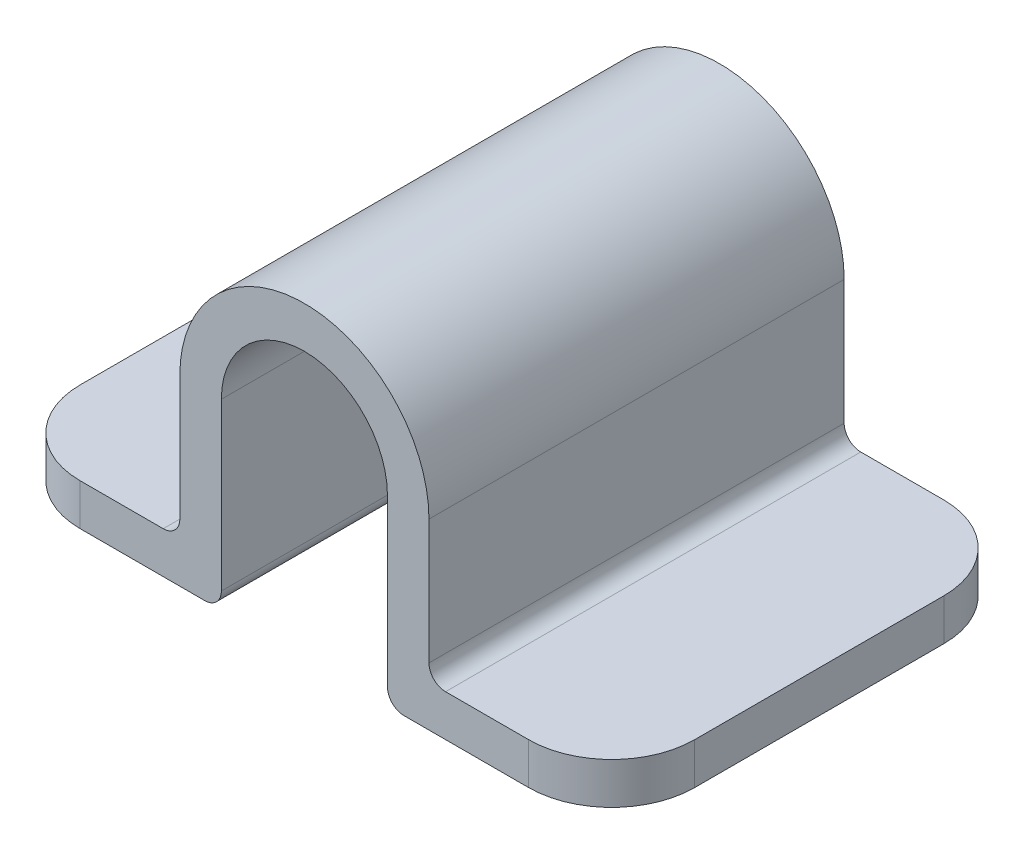
ISO-10303-21;
HEADER;
FILE_DESCRIPTION(('STEP AP214'),'2;1');
FILE_NAME('part.step','',(''),(''),'','','');
FILE_SCHEMA(('AUTOMOTIVE_DESIGN { 1 0 10303 214 1 1 1 1 }'));
ENDSEC;
DATA;
#1=APPLICATION_CONTEXT('core data for automotive mechanical design processes');
#2=APPLICATION_PROTOCOL_DEFINITION('international standard','automotive_design',2000,#1);
#3=PRODUCT_CONTEXT('',#1,'mechanical');
#4=PRODUCT('Part','Part','',(#3));
#5=PRODUCT_RELATED_PRODUCT_CATEGORY('part','',(#4));
#6=PRODUCT_DEFINITION_FORMATION('','',#4);
#7=PRODUCT_DEFINITION_CONTEXT('part definition',#1,'design');
#8=PRODUCT_DEFINITION('design','',#6,#7);
#9=PRODUCT_DEFINITION_SHAPE('','',#8);
#10=(LENGTH_UNIT() NAMED_UNIT(*) SI_UNIT(.MILLI.,.METRE.));
#11=(NAMED_UNIT(*) PLANE_ANGLE_UNIT() SI_UNIT($,.RADIAN.));
#12=(NAMED_UNIT(*) SI_UNIT($,.STERADIAN.) SOLID_ANGLE_UNIT());
#13=UNCERTAINTY_MEASURE_WITH_UNIT(LENGTH_MEASURE(1.E-05),#10,'distance_accuracy_value','');
#14=(GEOMETRIC_REPRESENTATION_CONTEXT(3) GLOBAL_UNCERTAINTY_ASSIGNED_CONTEXT((#13)) GLOBAL_UNIT_ASSIGNED_CONTEXT((#10,
#11,#12)) REPRESENTATION_CONTEXT('',''));
#15=CARTESIAN_POINT('',(0.,0.,0.));
#16=DIRECTION('',(0.,0.,1.));
#17=DIRECTION('',(1.,0.,0.));
#18=AXIS2_PLACEMENT_3D('',#15,#16,#17);
#19=CARTESIAN_POINT('',(0.,0.,-50.));
#20=DIRECTION('',(0.,0.,1.));
#21=DIRECTION('',(1.,0.,0.));
#22=AXIS2_PLACEMENT_3D('',#19,#20,#21);
#23=CYLINDRICAL_SURFACE('',#22,15.);
#24=CARTESIAN_POINT('',(0.,0.,0.));
#25=DIRECTION('',(0.,0.,1.));
#26=DIRECTION('',(1.,0.,0.));
#27=AXIS2_PLACEMENT_3D('',#24,#25,#26);
#28=CIRCLE('',#27,15.);
#29=CARTESIAN_POINT('',(15.,0.,0.));
#30=VERTEX_POINT('',#29);
#31=CARTESIAN_POINT('',(-15.,0.,0.));
#32=VERTEX_POINT('',#31);
#33=EDGE_CURVE('E263',#30,#32,#28,.T.);
#34=ORIENTED_EDGE('',*,*,#33,.F.);
#35=DIRECTION('',(0.,0.,1.));
#36=VECTOR('',#35,1.);
#37=CARTESIAN_POINT('',(15.,0.,-50.));
#38=LINE('',#37,#36);
#39=CARTESIAN_POINT('',(15.,0.,-50.));
#40=VERTEX_POINT('',#39);
#41=EDGE_CURVE('E213',#40,#30,#38,.T.);
#42=ORIENTED_EDGE('',*,*,#41,.F.);
#43=CARTESIAN_POINT('',(0.,0.,-50.));
#44=DIRECTION('',(0.,0.,1.));
#45=DIRECTION('',(1.,0.,0.));
#46=AXIS2_PLACEMENT_3D('',#43,#44,#45);
#47=CIRCLE('',#46,15.);
#48=CARTESIAN_POINT('',(-15.,0.,-50.));
#49=VERTEX_POINT('',#48);
#50=EDGE_CURVE('E206',#40,#49,#47,.T.);
#51=ORIENTED_EDGE('',*,*,#50,.T.);
#52=DIRECTION('',(0.,0.,1.));
#53=VECTOR('',#52,1.);
#54=CARTESIAN_POINT('',(-15.,0.,-50.));
#55=LINE('',#54,#53);
#56=EDGE_CURVE('E188',#49,#32,#55,.T.);
#57=ORIENTED_EDGE('',*,*,#56,.T.);
#58=EDGE_LOOP('',(#34,#42,#51,#57));
#59=FACE_BOUND('',#58,.T.);
#60=ADVANCED_FACE('F50',(#59),#23,.T.);
#61=CARTESIAN_POINT('',(15.,0.,-50.));
#62=DIRECTION('',(-1.,0.,0.));
#63=DIRECTION('',(0.,0.,1.));
#64=AXIS2_PLACEMENT_3D('',#61,#62,#63);
#65=PLANE('',#64);
#66=DIRECTION('',(0.,-1.,0.));
#67=VECTOR('',#66,1.);
#68=CARTESIAN_POINT('',(15.,0.,0.));
#69=LINE('',#68,#67);
#70=CARTESIAN_POINT('',(15.,-15.,0.));
#71=VERTEX_POINT('',#70);
#72=EDGE_CURVE('E216',#30,#71,#69,.T.);
#73=ORIENTED_EDGE('',*,*,#72,.T.);
#74=DIRECTION('',(0.,0.,1.));
#75=VECTOR('',#74,1.);
#76=CARTESIAN_POINT('',(15.,-15.,-50.));
#77=LINE('',#76,#75);
#78=CARTESIAN_POINT('',(15.,-15.,-50.));
#79=VERTEX_POINT('',#78);
#80=EDGE_CURVE('E310',#79,#71,#77,.T.);
#81=ORIENTED_EDGE('',*,*,#80,.F.);
#82=DIRECTION('',(0.,-1.,0.));
#83=VECTOR('',#82,1.);
#84=CARTESIAN_POINT('',(15.,0.,-50.));
#85=LINE('',#84,#83);
#86=EDGE_CURVE('E200',#40,#79,#85,.T.);
#87=ORIENTED_EDGE('',*,*,#86,.F.);
#88=ORIENTED_EDGE('',*,*,#41,.T.);
#89=EDGE_LOOP('',(#73,#81,#87,#88));
#90=FACE_BOUND('',#89,.T.);
#91=ADVANCED_FACE('F432',(#90),#65,.F.);
#92=CARTESIAN_POINT('',(17.,-15.,-50.));
#93=DIRECTION('',(0.,0.,1.));
#94=DIRECTION('',(1.,0.,0.));
#95=AXIS2_PLACEMENT_3D('',#92,#93,#94);
#96=CYLINDRICAL_SURFACE('',#95,2.);
#97=CARTESIAN_POINT('',(17.,-15.,0.));
#98=DIRECTION('',(0.,0.,-1.));
#99=DIRECTION('',(-1.,0.,0.));
#100=AXIS2_PLACEMENT_3D('',#97,#98,#99);
#101=CIRCLE('',#100,2.);
#102=CARTESIAN_POINT('',(17.,-17.,0.));
#103=VERTEX_POINT('',#102);
#104=EDGE_CURVE('E220',#103,#71,#101,.T.);
#105=ORIENTED_EDGE('',*,*,#104,.F.);
#106=DIRECTION('',(0.,0.,1.));
#107=VECTOR('',#106,1.);
#108=CARTESIAN_POINT('',(17.,-17.,-50.));
#109=LINE('',#108,#107);
#110=CARTESIAN_POINT('',(17.,-17.,-50.));
#111=VERTEX_POINT('',#110);
#112=EDGE_CURVE('E313',#111,#103,#109,.T.);
#113=ORIENTED_EDGE('',*,*,#112,.F.);
#114=CARTESIAN_POINT('',(17.,-15.,-50.));
#115=DIRECTION('',(0.,0.,-1.));
#116=DIRECTION('',(-1.,0.,0.));
#117=AXIS2_PLACEMENT_3D('',#114,#115,#116);
#118=CIRCLE('',#117,2.);
#119=EDGE_CURVE('E257',#111,#79,#118,.T.);
#120=ORIENTED_EDGE('',*,*,#119,.T.);
#121=ORIENTED_EDGE('',*,*,#80,.T.);
#122=EDGE_LOOP('',(#105,#113,#120,#121));
#123=FACE_BOUND('',#122,.T.);
#124=ADVANCED_FACE('F437',(#123),#96,.F.);
#125=CARTESIAN_POINT('',(17.,-17.,-50.));
#126=DIRECTION('',(0.,-1.,0.));
#127=DIRECTION('',(0.,0.,-1.));
#128=AXIS2_PLACEMENT_3D('',#125,#126,#127);
#129=PLANE('',#128);
#130=DIRECTION('',(1.,0.,0.));
#131=VECTOR('',#130,1.);
#132=CARTESIAN_POINT('',(17.,-17.,0.));
#133=LINE('',#132,#131);
#134=CARTESIAN_POINT('',(27.,-17.,0.));
#135=VERTEX_POINT('',#134);
#136=EDGE_CURVE('E300',#103,#135,#133,.T.);
#137=ORIENTED_EDGE('',*,*,#136,.T.);
#138=CARTESIAN_POINT('',(27.,-17.,-10.));
#139=DIRECTION('',(0.,-1.,0.));
#140=DIRECTION('',(0.,0.,-1.));
#141=AXIS2_PLACEMENT_3D('',#138,#139,#140);
#142=CIRCLE('',#141,10.);
#143=CARTESIAN_POINT('',(37.,-17.,-10.));
#144=VERTEX_POINT('',#143);
#145=EDGE_CURVE('E378',#135,#144,#142,.F.);
#146=ORIENTED_EDGE('',*,*,#145,.T.);
#147=DIRECTION('',(0.,0.,1.));
#148=VECTOR('',#147,1.);
#149=CARTESIAN_POINT('',(37.,-17.,-50.));
#150=LINE('',#149,#148);
#151=CARTESIAN_POINT('',(37.,-17.,-40.));
#152=VERTEX_POINT('',#151);
#153=EDGE_CURVE('E316',#152,#144,#150,.T.);
#154=ORIENTED_EDGE('',*,*,#153,.F.);
#155=CARTESIAN_POINT('',(27.,-17.,-40.));
#156=DIRECTION('',(0.,-1.,0.));
#157=DIRECTION('',(0.,0.,-1.));
#158=AXIS2_PLACEMENT_3D('',#155,#156,#157);
#159=CIRCLE('',#158,10.);
#160=CARTESIAN_POINT('',(27.,-17.,-50.));
#161=VERTEX_POINT('',#160);
#162=EDGE_CURVE('E375',#152,#161,#159,.F.);
#163=ORIENTED_EDGE('',*,*,#162,.T.);
#164=DIRECTION('',(1.,0.,0.));
#165=VECTOR('',#164,1.);
#166=CARTESIAN_POINT('',(17.,-17.,-50.));
#167=LINE('',#166,#165);
#168=EDGE_CURVE('E254',#111,#161,#167,.T.);
#169=ORIENTED_EDGE('',*,*,#168,.F.);
#170=ORIENTED_EDGE('',*,*,#112,.T.);
#171=EDGE_LOOP('',(#137,#146,#154,#163,#169,#170));
#172=FACE_BOUND('',#171,.T.);
#173=ADVANCED_FACE('F518',(#172),#129,.F.);
#174=CARTESIAN_POINT('',(37.,-17.,-50.));
#175=DIRECTION('',(-1.,0.,0.));
#176=DIRECTION('',(0.,0.,1.));
#177=AXIS2_PLACEMENT_3D('',#174,#175,#176);
#178=PLANE('',#177);
#179=ORIENTED_EDGE('',*,*,#153,.T.);
#180=DIRECTION('',(0.,-1.,0.));
#181=VECTOR('',#180,1.);
#182=CARTESIAN_POINT('',(37.,-22.,-10.));
#183=LINE('',#182,#181);
#184=CARTESIAN_POINT('',(37.,-22.,-10.));
#185=VERTEX_POINT('',#184);
#186=EDGE_CURVE('E359',#144,#185,#183,.T.);
#187=ORIENTED_EDGE('',*,*,#186,.T.);
#188=DIRECTION('',(0.,0.,1.));
#189=VECTOR('',#188,1.);
#190=CARTESIAN_POINT('',(37.,-22.,-50.));
#191=LINE('',#190,#189);
#192=CARTESIAN_POINT('',(37.,-22.,-40.));
#193=VERTEX_POINT('',#192);
#194=EDGE_CURVE('E320',#193,#185,#191,.T.);
#195=ORIENTED_EDGE('',*,*,#194,.F.);
#196=DIRECTION('',(0.,-1.,0.));
#197=VECTOR('',#196,1.);
#198=CARTESIAN_POINT('',(37.,-17.,-40.));
#199=LINE('',#198,#197);
#200=EDGE_CURVE('E309',#193,#152,#199,.F.);
#201=ORIENTED_EDGE('',*,*,#200,.T.);
#202=EDGE_LOOP('',(#179,#187,#195,#201));
#203=FACE_BOUND('',#202,.T.);
#204=ADVANCED_FACE('F509',(#203),#178,.F.);
#205=CARTESIAN_POINT('',(12.,-22.,-50.));
#206=DIRECTION('',(0.,-1.,0.));
#207=DIRECTION('',(0.,0.,-1.));
#208=AXIS2_PLACEMENT_3D('',#205,#206,#207);
#209=PLANE('',#208);
#210=ORIENTED_EDGE('',*,*,#194,.T.);
#211=CARTESIAN_POINT('',(27.,-22.,-10.));
#212=DIRECTION('',(0.,-1.,0.));
#213=DIRECTION('',(0.,0.,-1.));
#214=AXIS2_PLACEMENT_3D('',#211,#212,#213);
#215=CIRCLE('',#214,10.);
#216=CARTESIAN_POINT('',(27.,-22.,0.));
#217=VERTEX_POINT('',#216);
#218=EDGE_CURVE('E366',#185,#217,#215,.T.);
#219=ORIENTED_EDGE('',*,*,#218,.T.);
#220=DIRECTION('',(1.,0.,0.));
#221=VECTOR('',#220,1.);
#222=CARTESIAN_POINT('',(12.,-22.,0.));
#223=LINE('',#222,#221);
#224=CARTESIAN_POINT('',(12.,-22.,0.));
#225=VERTEX_POINT('',#224);
#226=EDGE_CURVE('E296',#225,#217,#223,.T.);
#227=ORIENTED_EDGE('',*,*,#226,.F.);
#228=DIRECTION('',(0.,0.,1.));
#229=VECTOR('',#228,1.);
#230=CARTESIAN_POINT('',(12.,-22.,-50.));
#231=LINE('',#230,#229);
#232=CARTESIAN_POINT('',(12.,-22.,-50.));
#233=VERTEX_POINT('',#232);
#234=EDGE_CURVE('E324',#233,#225,#231,.T.);
#235=ORIENTED_EDGE('',*,*,#234,.F.);
#236=DIRECTION('',(1.,0.,0.));
#237=VECTOR('',#236,1.);
#238=CARTESIAN_POINT('',(12.,-22.,-50.));
#239=LINE('',#238,#237);
#240=CARTESIAN_POINT('',(27.,-22.,-50.));
#241=VERTEX_POINT('',#240);
#242=EDGE_CURVE('E250',#233,#241,#239,.T.);
#243=ORIENTED_EDGE('',*,*,#242,.T.);
#244=CARTESIAN_POINT('',(27.,-22.,-40.));
#245=DIRECTION('',(0.,-1.,0.));
#246=DIRECTION('',(0.,0.,-1.));
#247=AXIS2_PLACEMENT_3D('',#244,#245,#246);
#248=CIRCLE('',#247,10.);
#249=EDGE_CURVE('E363',#241,#193,#248,.T.);
#250=ORIENTED_EDGE('',*,*,#249,.T.);
#251=EDGE_LOOP('',(#210,#219,#227,#235,#243,#250));
#252=FACE_BOUND('',#251,.T.);
#253=ADVANCED_FACE('F504',(#252),#209,.T.);
#254=CARTESIAN_POINT('',(12.,-20.,-50.));
#255=DIRECTION('',(0.,0.,1.));
#256=DIRECTION('',(1.,0.,0.));
#257=AXIS2_PLACEMENT_3D('',#254,#255,#256);
#258=CYLINDRICAL_SURFACE('',#257,2.);
#259=CARTESIAN_POINT('',(12.,-20.,0.));
#260=DIRECTION('',(0.,0.,1.));
#261=DIRECTION('',(1.,0.,0.));
#262=AXIS2_PLACEMENT_3D('',#259,#260,#261);
#263=CIRCLE('',#262,2.);
#264=CARTESIAN_POINT('',(10.,-20.,0.));
#265=VERTEX_POINT('',#264);
#266=EDGE_CURVE('E292',#265,#225,#263,.T.);
#267=ORIENTED_EDGE('',*,*,#266,.F.);
#268=DIRECTION('',(0.,0.,1.));
#269=VECTOR('',#268,1.);
#270=CARTESIAN_POINT('',(10.,-20.,-50.));
#271=LINE('',#270,#269);
#272=CARTESIAN_POINT('',(10.,-20.,-50.));
#273=VERTEX_POINT('',#272);
#274=EDGE_CURVE('E327',#273,#265,#271,.T.);
#275=ORIENTED_EDGE('',*,*,#274,.F.);
#276=CARTESIAN_POINT('',(12.,-20.,-50.));
#277=DIRECTION('',(0.,0.,1.));
#278=DIRECTION('',(1.,0.,0.));
#279=AXIS2_PLACEMENT_3D('',#276,#277,#278);
#280=CIRCLE('',#279,2.);
#281=EDGE_CURVE('E246',#273,#233,#280,.T.);
#282=ORIENTED_EDGE('',*,*,#281,.T.);
#283=ORIENTED_EDGE('',*,*,#234,.T.);
#284=EDGE_LOOP('',(#267,#275,#282,#283));
#285=FACE_BOUND('',#284,.T.);
#286=ADVANCED_FACE('F508',(#285),#258,.T.);
#287=CARTESIAN_POINT('',(10.,0.,-50.));
#288=DIRECTION('',(-1.,0.,0.));
#289=DIRECTION('',(0.,0.,1.));
#290=AXIS2_PLACEMENT_3D('',#287,#288,#289);
#291=PLANE('',#290);
#292=DIRECTION('',(0.,-1.,0.));
#293=VECTOR('',#292,1.);
#294=CARTESIAN_POINT('',(10.,0.,0.));
#295=LINE('',#294,#293);
#296=CARTESIAN_POINT('',(10.,0.,0.));
#297=VERTEX_POINT('',#296);
#298=EDGE_CURVE('E288',#297,#265,#295,.T.);
#299=ORIENTED_EDGE('',*,*,#298,.F.);
#300=DIRECTION('',(0.,0.,1.));
#301=VECTOR('',#300,1.);
#302=CARTESIAN_POINT('',(10.,0.,-50.));
#303=LINE('',#302,#301);
#304=CARTESIAN_POINT('',(10.,0.,-50.));
#305=VERTEX_POINT('',#304);
#306=EDGE_CURVE('E330',#305,#297,#303,.T.);
#307=ORIENTED_EDGE('',*,*,#306,.F.);
#308=DIRECTION('',(0.,-1.,0.));
#309=VECTOR('',#308,1.);
#310=CARTESIAN_POINT('',(10.,0.,-50.));
#311=LINE('',#310,#309);
#312=EDGE_CURVE('E242',#305,#273,#311,.T.);
#313=ORIENTED_EDGE('',*,*,#312,.T.);
#314=ORIENTED_EDGE('',*,*,#274,.T.);
#315=EDGE_LOOP('',(#299,#307,#313,#314));
#316=FACE_BOUND('',#315,.T.);
#317=ADVANCED_FACE('F564',(#316),#291,.T.);
#318=CARTESIAN_POINT('',(0.,0.,-50.));
#319=DIRECTION('',(0.,0.,1.));
#320=DIRECTION('',(1.,0.,0.));
#321=AXIS2_PLACEMENT_3D('',#318,#319,#320);
#322=CYLINDRICAL_SURFACE('',#321,10.);
#323=CARTESIAN_POINT('',(0.,0.,0.));
#324=DIRECTION('',(0.,0.,1.));
#325=DIRECTION('',(1.,0.,0.));
#326=AXIS2_PLACEMENT_3D('',#323,#324,#325);
#327=CIRCLE('',#326,10.);
#328=CARTESIAN_POINT('',(-10.,0.,0.));
#329=VERTEX_POINT('',#328);
#330=EDGE_CURVE('E285',#297,#329,#327,.T.);
#331=ORIENTED_EDGE('',*,*,#330,.T.);
#332=DIRECTION('',(0.,0.,1.));
#333=VECTOR('',#332,1.);
#334=CARTESIAN_POINT('',(-10.,0.,-50.));
#335=LINE('',#334,#333);
#336=CARTESIAN_POINT('',(-10.,0.,-50.));
#337=VERTEX_POINT('',#336);
#338=EDGE_CURVE('E333',#337,#329,#335,.T.);
#339=ORIENTED_EDGE('',*,*,#338,.F.);
#340=CARTESIAN_POINT('',(0.,0.,-50.));
#341=DIRECTION('',(0.,0.,1.));
#342=DIRECTION('',(1.,0.,0.));
#343=AXIS2_PLACEMENT_3D('',#340,#341,#342);
#344=CIRCLE('',#343,10.);
#345=EDGE_CURVE('E239',#305,#337,#344,.T.);
#346=ORIENTED_EDGE('',*,*,#345,.F.);
#347=ORIENTED_EDGE('',*,*,#306,.T.);
#348=EDGE_LOOP('',(#331,#339,#346,#347));
#349=FACE_BOUND('',#348,.T.);
#350=ADVANCED_FACE('F554',(#349),#322,.F.);
#351=CARTESIAN_POINT('',(-10.,0.,-50.));
#352=DIRECTION('',(-1.,0.,0.));
#353=DIRECTION('',(0.,0.,1.));
#354=AXIS2_PLACEMENT_3D('',#351,#352,#353);
#355=PLANE('',#354);
#356=DIRECTION('',(0.,-1.,0.));
#357=VECTOR('',#356,1.);
#358=CARTESIAN_POINT('',(-10.,0.,0.));
#359=LINE('',#358,#357);
#360=CARTESIAN_POINT('',(-10.,-20.,0.));
#361=VERTEX_POINT('',#360);
#362=EDGE_CURVE('E282',#329,#361,#359,.T.);
#363=ORIENTED_EDGE('',*,*,#362,.T.);
#364=DIRECTION('',(0.,0.,1.));
#365=VECTOR('',#364,1.);
#366=CARTESIAN_POINT('',(-10.,-20.,-50.));
#367=LINE('',#366,#365);
#368=CARTESIAN_POINT('',(-10.,-20.,-50.));
#369=VERTEX_POINT('',#368);
#370=EDGE_CURVE('E337',#369,#361,#367,.T.);
#371=ORIENTED_EDGE('',*,*,#370,.F.);
#372=DIRECTION('',(0.,-1.,0.));
#373=VECTOR('',#372,1.);
#374=CARTESIAN_POINT('',(-10.,0.,-50.));
#375=LINE('',#374,#373);
#376=EDGE_CURVE('E236',#337,#369,#375,.T.);
#377=ORIENTED_EDGE('',*,*,#376,.F.);
#378=ORIENTED_EDGE('',*,*,#338,.T.);
#379=EDGE_LOOP('',(#363,#371,#377,#378));
#380=FACE_BOUND('',#379,.T.);
#381=ADVANCED_FACE('F544',(#380),#355,.F.);
#382=CARTESIAN_POINT('',(-12.,-20.,-50.));
#383=DIRECTION('',(0.,0.,1.));
#384=DIRECTION('',(1.,0.,0.));
#385=AXIS2_PLACEMENT_3D('',#382,#383,#384);
#386=CYLINDRICAL_SURFACE('',#385,2.);
#387=CARTESIAN_POINT('',(-12.,-20.,0.));
#388=DIRECTION('',(0.,0.,-1.));
#389=DIRECTION('',(-1.,0.,0.));
#390=AXIS2_PLACEMENT_3D('',#387,#388,#389);
#391=CIRCLE('',#390,2.);
#392=CARTESIAN_POINT('',(-12.,-22.,0.));
#393=VERTEX_POINT('',#392);
#394=EDGE_CURVE('E279',#361,#393,#391,.T.);
#395=ORIENTED_EDGE('',*,*,#394,.T.);
#396=DIRECTION('',(0.,0.,1.));
#397=VECTOR('',#396,1.);
#398=CARTESIAN_POINT('',(-12.,-22.,-50.));
#399=LINE('',#398,#397);
#400=CARTESIAN_POINT('',(-12.,-22.,-50.));
#401=VERTEX_POINT('',#400);
#402=EDGE_CURVE('E341',#401,#393,#399,.T.);
#403=ORIENTED_EDGE('',*,*,#402,.F.);
#404=CARTESIAN_POINT('',(-12.,-20.,-50.));
#405=DIRECTION('',(0.,0.,-1.));
#406=DIRECTION('',(-1.,0.,0.));
#407=AXIS2_PLACEMENT_3D('',#404,#405,#406);
#408=CIRCLE('',#407,2.);
#409=EDGE_CURVE('E233',#369,#401,#408,.T.);
#410=ORIENTED_EDGE('',*,*,#409,.F.);
#411=ORIENTED_EDGE('',*,*,#370,.T.);
#412=EDGE_LOOP('',(#395,#403,#410,#411));
#413=FACE_BOUND('',#412,.T.);
#414=ADVANCED_FACE('F499',(#413),#386,.T.);
#415=CARTESIAN_POINT('',(-12.,-22.,-50.));
#416=DIRECTION('',(0.,1.,0.));
#417=DIRECTION('',(0.,0.,1.));
#418=AXIS2_PLACEMENT_3D('',#415,#416,#417);
#419=PLANE('',#418);
#420=DIRECTION('',(-1.,0.,0.));
#421=VECTOR('',#420,1.);
#422=CARTESIAN_POINT('',(-12.,-22.,0.));
#423=LINE('',#422,#421);
#424=CARTESIAN_POINT('',(-27.,-22.,0.));
#425=VERTEX_POINT('',#424);
#426=EDGE_CURVE('E276',#393,#425,#423,.T.);
#427=ORIENTED_EDGE('',*,*,#426,.T.);
#428=CARTESIAN_POINT('',(-27.,-22.,-10.));
#429=DIRECTION('',(0.,1.,0.));
#430=DIRECTION('',(0.,0.,1.));
#431=AXIS2_PLACEMENT_3D('',#428,#429,#430);
#432=CIRCLE('',#431,10.);
#433=CARTESIAN_POINT('',(-37.,-22.,-10.));
#434=VERTEX_POINT('',#433);
#435=EDGE_CURVE('E13',#425,#434,#432,.F.);
#436=ORIENTED_EDGE('',*,*,#435,.T.);
#437=DIRECTION('',(0.,0.,1.));
#438=VECTOR('',#437,1.);
#439=CARTESIAN_POINT('',(-37.,-22.,-50.));
#440=LINE('',#439,#438);
#441=CARTESIAN_POINT('',(-37.,-22.,-40.));
#442=VERTEX_POINT('',#441);
#443=EDGE_CURVE('E345',#442,#434,#440,.T.);
#444=ORIENTED_EDGE('',*,*,#443,.F.);
#445=CARTESIAN_POINT('',(-27.,-22.,-40.));
#446=DIRECTION('',(0.,1.,0.));
#447=DIRECTION('',(0.,0.,1.));
#448=AXIS2_PLACEMENT_3D('',#445,#446,#447);
#449=CIRCLE('',#448,10.);
#450=CARTESIAN_POINT('',(-27.,-22.,-50.));
#451=VERTEX_POINT('',#450);
#452=EDGE_CURVE('E59',#442,#451,#449,.F.);
#453=ORIENTED_EDGE('',*,*,#452,.T.);
#454=DIRECTION('',(-1.,0.,0.));
#455=VECTOR('',#454,1.);
#456=CARTESIAN_POINT('',(-12.,-22.,-50.));
#457=LINE('',#456,#455);
#458=EDGE_CURVE('E229',#401,#451,#457,.T.);
#459=ORIENTED_EDGE('',*,*,#458,.F.);
#460=ORIENTED_EDGE('',*,*,#402,.T.);
#461=EDGE_LOOP('',(#427,#436,#444,#453,#459,#460));
#462=FACE_BOUND('',#461,.T.);
#463=ADVANCED_FACE('F403',(#462),#419,.F.);
#464=CARTESIAN_POINT('',(-37.,-22.,-50.));
#465=DIRECTION('',(1.,0.,0.));
#466=DIRECTION('',(0.,0.,-1.));
#467=AXIS2_PLACEMENT_3D('',#464,#465,#466);
#468=PLANE('',#467);
#469=ORIENTED_EDGE('',*,*,#443,.T.);
#470=DIRECTION('',(0.,1.,0.));
#471=VECTOR('',#470,1.);
#472=CARTESIAN_POINT('',(-37.,-17.,-10.));
#473=LINE('',#472,#471);
#474=CARTESIAN_POINT('',(-37.,-17.,-10.));
#475=VERTEX_POINT('',#474);
#476=EDGE_CURVE('E391',#434,#475,#473,.T.);
#477=ORIENTED_EDGE('',*,*,#476,.T.);
#478=DIRECTION('',(0.,0.,1.));
#479=VECTOR('',#478,1.);
#480=CARTESIAN_POINT('',(-37.,-17.,-50.));
#481=LINE('',#480,#479);
#482=CARTESIAN_POINT('',(-37.,-17.,-40.));
#483=VERTEX_POINT('',#482);
#484=EDGE_CURVE('E348',#483,#475,#481,.T.);
#485=ORIENTED_EDGE('',*,*,#484,.F.);
#486=DIRECTION('',(0.,1.,0.));
#487=VECTOR('',#486,1.);
#488=CARTESIAN_POINT('',(-37.,-22.,-40.));
#489=LINE('',#488,#487);
#490=EDGE_CURVE('E71',#483,#442,#489,.F.);
#491=ORIENTED_EDGE('',*,*,#490,.T.);
#492=EDGE_LOOP('',(#469,#477,#485,#491));
#493=FACE_BOUND('',#492,.T.);
#494=ADVANCED_FACE('F410',(#493),#468,.F.);
#495=CARTESIAN_POINT('',(-17.,-17.,-50.));
#496=DIRECTION('',(0.,1.,0.));
#497=DIRECTION('',(0.,0.,1.));
#498=AXIS2_PLACEMENT_3D('',#495,#496,#497);
#499=PLANE('',#498);
#500=ORIENTED_EDGE('',*,*,#484,.T.);
#501=CARTESIAN_POINT('',(-27.,-17.,-10.));
#502=DIRECTION('',(0.,1.,0.));
#503=DIRECTION('',(0.,0.,1.));
#504=AXIS2_PLACEMENT_3D('',#501,#502,#503);
#505=CIRCLE('',#504,10.);
#506=CARTESIAN_POINT('',(-27.,-17.,0.));
#507=VERTEX_POINT('',#506);
#508=EDGE_CURVE('E398',#475,#507,#505,.T.);
#509=ORIENTED_EDGE('',*,*,#508,.T.);
#510=DIRECTION('',(-1.,0.,0.));
#511=VECTOR('',#510,1.);
#512=CARTESIAN_POINT('',(-17.,-17.,0.));
#513=LINE('',#512,#511);
#514=CARTESIAN_POINT('',(-17.,-17.,0.));
#515=VERTEX_POINT('',#514);
#516=EDGE_CURVE('E272',#515,#507,#513,.T.);
#517=ORIENTED_EDGE('',*,*,#516,.F.);
#518=DIRECTION('',(0.,0.,1.));
#519=VECTOR('',#518,1.);
#520=CARTESIAN_POINT('',(-17.,-17.,-50.));
#521=LINE('',#520,#519);
#522=CARTESIAN_POINT('',(-17.,-17.,-50.));
#523=VERTEX_POINT('',#522);
#524=EDGE_CURVE('E352',#523,#515,#521,.T.);
#525=ORIENTED_EDGE('',*,*,#524,.F.);
#526=DIRECTION('',(-1.,0.,0.));
#527=VECTOR('',#526,1.);
#528=CARTESIAN_POINT('',(-17.,-17.,-50.));
#529=LINE('',#528,#527);
#530=CARTESIAN_POINT('',(-27.,-17.,-50.));
#531=VERTEX_POINT('',#530);
#532=EDGE_CURVE('E225',#523,#531,#529,.T.);
#533=ORIENTED_EDGE('',*,*,#532,.T.);
#534=CARTESIAN_POINT('',(-27.,-17.,-40.));
#535=DIRECTION('',(0.,1.,0.));
#536=DIRECTION('',(0.,0.,1.));
#537=AXIS2_PLACEMENT_3D('',#534,#535,#536);
#538=CIRCLE('',#537,10.);
#539=EDGE_CURVE('E395',#531,#483,#538,.T.);
#540=ORIENTED_EDGE('',*,*,#539,.T.);
#541=EDGE_LOOP('',(#500,#509,#517,#525,#533,#540));
#542=FACE_BOUND('',#541,.T.);
#543=ADVANCED_FACE('F409',(#542),#499,.T.);
#544=CARTESIAN_POINT('',(-17.,-15.,-50.));
#545=DIRECTION('',(0.,0.,1.));
#546=DIRECTION('',(1.,0.,0.));
#547=AXIS2_PLACEMENT_3D('',#544,#545,#546);
#548=CYLINDRICAL_SURFACE('',#547,2.);
#549=CARTESIAN_POINT('',(-17.,-15.,0.));
#550=DIRECTION('',(0.,0.,1.));
#551=DIRECTION('',(1.,0.,0.));
#552=AXIS2_PLACEMENT_3D('',#549,#550,#551);
#553=CIRCLE('',#552,2.);
#554=CARTESIAN_POINT('',(-15.,-15.,0.));
#555=VERTEX_POINT('',#554);
#556=EDGE_CURVE('E268',#515,#555,#553,.T.);
#557=ORIENTED_EDGE('',*,*,#556,.T.);
#558=DIRECTION('',(0.,0.,1.));
#559=VECTOR('',#558,1.);
#560=CARTESIAN_POINT('',(-15.,-15.,-50.));
#561=LINE('',#560,#559);
#562=CARTESIAN_POINT('',(-15.,-15.,-50.));
#563=VERTEX_POINT('',#562);
#564=EDGE_CURVE('E199',#563,#555,#561,.T.);
#565=ORIENTED_EDGE('',*,*,#564,.F.);
#566=CARTESIAN_POINT('',(-17.,-15.,-50.));
#567=DIRECTION('',(0.,0.,1.));
#568=DIRECTION('',(1.,0.,0.));
#569=AXIS2_PLACEMENT_3D('',#566,#567,#568);
#570=CIRCLE('',#569,2.);
#571=EDGE_CURVE('E209',#523,#563,#570,.T.);
#572=ORIENTED_EDGE('',*,*,#571,.F.);
#573=ORIENTED_EDGE('',*,*,#524,.T.);
#574=EDGE_LOOP('',(#557,#565,#572,#573));
#575=FACE_BOUND('',#574,.T.);
#576=ADVANCED_FACE('F421',(#575),#548,.F.);
#577=CARTESIAN_POINT('',(-15.,0.,-50.));
#578=DIRECTION('',(-1.,0.,0.));
#579=DIRECTION('',(0.,0.,1.));
#580=AXIS2_PLACEMENT_3D('',#577,#578,#579);
#581=PLANE('',#580);
#582=DIRECTION('',(0.,-1.,0.));
#583=VECTOR('',#582,1.);
#584=CARTESIAN_POINT('',(-15.,0.,0.));
#585=LINE('',#584,#583);
#586=EDGE_CURVE('E193',#32,#555,#585,.T.);
#587=ORIENTED_EDGE('',*,*,#586,.F.);
#588=ORIENTED_EDGE('',*,*,#56,.F.);
#589=DIRECTION('',(0.,-1.,0.));
#590=VECTOR('',#589,1.);
#591=CARTESIAN_POINT('',(-15.,0.,-50.));
#592=LINE('',#591,#590);
#593=EDGE_CURVE('E191',#49,#563,#592,.T.);
#594=ORIENTED_EDGE('',*,*,#593,.T.);
#595=ORIENTED_EDGE('',*,*,#564,.T.);
#596=EDGE_LOOP('',(#587,#588,#594,#595));
#597=FACE_BOUND('',#596,.T.);
#598=ADVANCED_FACE('F190',(#597),#581,.T.);
#599=CARTESIAN_POINT('',(0.,0.,-50.));
#600=DIRECTION('',(0.,0.,1.));
#601=DIRECTION('',(1.,0.,0.));
#602=AXIS2_PLACEMENT_3D('',#599,#600,#601);
#603=PLANE('',#602);
#604=ORIENTED_EDGE('',*,*,#168,.T.);
#605=DIRECTION('',(0.,-1.,0.));
#606=VECTOR('',#605,1.);
#607=CARTESIAN_POINT('',(27.,0.,-50.));
#608=LINE('',#607,#606);
#609=EDGE_CURVE('E385',#161,#241,#608,.T.);
#610=ORIENTED_EDGE('',*,*,#609,.T.);
#611=ORIENTED_EDGE('',*,*,#242,.F.);
#612=ORIENTED_EDGE('',*,*,#281,.F.);
#613=ORIENTED_EDGE('',*,*,#312,.F.);
#614=ORIENTED_EDGE('',*,*,#345,.T.);
#615=ORIENTED_EDGE('',*,*,#376,.T.);
#616=ORIENTED_EDGE('',*,*,#409,.T.);
#617=ORIENTED_EDGE('',*,*,#458,.T.);
#618=DIRECTION('',(0.,1.,0.));
#619=VECTOR('',#618,1.);
#620=CARTESIAN_POINT('',(-27.,0.,-50.));
#621=LINE('',#620,#619);
#622=EDGE_CURVE('E381',#451,#531,#621,.T.);
#623=ORIENTED_EDGE('',*,*,#622,.T.);
#624=ORIENTED_EDGE('',*,*,#532,.F.);
#625=ORIENTED_EDGE('',*,*,#571,.T.);
#626=ORIENTED_EDGE('',*,*,#593,.F.);
#627=ORIENTED_EDGE('',*,*,#50,.F.);
#628=ORIENTED_EDGE('',*,*,#86,.T.);
#629=ORIENTED_EDGE('',*,*,#119,.F.);
#630=EDGE_LOOP('',(#604,#610,#611,#612,#613,#614,#615,#616,#617,#623,#624,#625,#626,#627,#628,#629));
#631=FACE_BOUND('',#630,.T.);
#632=ADVANCED_FACE('F205',(#631),#603,.F.);
#633=CARTESIAN_POINT('',(0.,0.,0.));
#634=DIRECTION('',(0.,0.,1.));
#635=DIRECTION('',(1.,0.,0.));
#636=AXIS2_PLACEMENT_3D('',#633,#634,#635);
#637=PLANE('',#636);
#638=ORIENTED_EDGE('',*,*,#226,.T.);
#639=DIRECTION('',(0.,-1.,0.));
#640=VECTOR('',#639,1.);
#641=CARTESIAN_POINT('',(27.,-17.,0.));
#642=LINE('',#641,#640);
#643=EDGE_CURVE('E372',#217,#135,#642,.F.);
#644=ORIENTED_EDGE('',*,*,#643,.T.);
#645=ORIENTED_EDGE('',*,*,#136,.F.);
#646=ORIENTED_EDGE('',*,*,#104,.T.);
#647=ORIENTED_EDGE('',*,*,#72,.F.);
#648=ORIENTED_EDGE('',*,*,#33,.T.);
#649=ORIENTED_EDGE('',*,*,#586,.T.);
#650=ORIENTED_EDGE('',*,*,#556,.F.);
#651=ORIENTED_EDGE('',*,*,#516,.T.);
#652=DIRECTION('',(0.,1.,0.));
#653=VECTOR('',#652,1.);
#654=CARTESIAN_POINT('',(-27.,-22.,0.));
#655=LINE('',#654,#653);
#656=EDGE_CURVE('E369',#507,#425,#655,.F.);
#657=ORIENTED_EDGE('',*,*,#656,.T.);
#658=ORIENTED_EDGE('',*,*,#426,.F.);
#659=ORIENTED_EDGE('',*,*,#394,.F.);
#660=ORIENTED_EDGE('',*,*,#362,.F.);
#661=ORIENTED_EDGE('',*,*,#330,.F.);
#662=ORIENTED_EDGE('',*,*,#298,.T.);
#663=ORIENTED_EDGE('',*,*,#266,.T.);
#664=EDGE_LOOP('',(#638,#644,#645,#646,#647,#648,#649,#650,#651,#657,#658,#659,#660,#661,#662,#663));
#665=FACE_BOUND('',#664,.T.);
#666=ADVANCED_FACE('F418',(#665),#637,.T.);
#667=CARTESIAN_POINT('',(27.,-17.,-10.));
#668=DIRECTION('',(0.,1.,0.));
#669=DIRECTION('',(0.,0.,1.));
#670=AXIS2_PLACEMENT_3D('',#667,#668,#669);
#671=CYLINDRICAL_SURFACE('',#670,10.);
#672=ORIENTED_EDGE('',*,*,#145,.F.);
#673=ORIENTED_EDGE('',*,*,#643,.F.);
#674=ORIENTED_EDGE('',*,*,#218,.F.);
#675=ORIENTED_EDGE('',*,*,#186,.F.);
#676=EDGE_LOOP('',(#672,#673,#674,#675));
#677=FACE_BOUND('',#676,.T.);
#678=ADVANCED_FACE('F441',(#677),#671,.T.);
#679=CARTESIAN_POINT('',(27.,0.,-40.));
#680=DIRECTION('',(0.,-1.,0.));
#681=DIRECTION('',(0.,0.,-1.));
#682=AXIS2_PLACEMENT_3D('',#679,#680,#681);
#683=CYLINDRICAL_SURFACE('',#682,10.);
#684=ORIENTED_EDGE('',*,*,#162,.F.);
#685=ORIENTED_EDGE('',*,*,#200,.F.);
#686=ORIENTED_EDGE('',*,*,#249,.F.);
#687=ORIENTED_EDGE('',*,*,#609,.F.);
#688=EDGE_LOOP('',(#684,#685,#686,#687));
#689=FACE_BOUND('',#688,.T.);
#690=ADVANCED_FACE('F444',(#689),#683,.T.);
#691=CARTESIAN_POINT('',(-27.,-22.,-10.));
#692=DIRECTION('',(0.,-1.,0.));
#693=DIRECTION('',(0.,0.,-1.));
#694=AXIS2_PLACEMENT_3D('',#691,#692,#693);
#695=CYLINDRICAL_SURFACE('',#694,10.);
#696=ORIENTED_EDGE('',*,*,#435,.F.);
#697=ORIENTED_EDGE('',*,*,#656,.F.);
#698=ORIENTED_EDGE('',*,*,#508,.F.);
#699=ORIENTED_EDGE('',*,*,#476,.F.);
#700=EDGE_LOOP('',(#696,#697,#698,#699));
#701=FACE_BOUND('',#700,.T.);
#702=ADVANCED_FACE('F413',(#701),#695,.T.);
#703=CARTESIAN_POINT('',(-27.,0.,-40.));
#704=DIRECTION('',(0.,1.,0.));
#705=DIRECTION('',(0.,0.,1.));
#706=AXIS2_PLACEMENT_3D('',#703,#704,#705);
#707=CYLINDRICAL_SURFACE('',#706,10.);
#708=ORIENTED_EDGE('',*,*,#452,.F.);
#709=ORIENTED_EDGE('',*,*,#490,.F.);
#710=ORIENTED_EDGE('',*,*,#539,.F.);
#711=ORIENTED_EDGE('',*,*,#622,.F.);
#712=EDGE_LOOP('',(#708,#709,#710,#711));
#713=FACE_BOUND('',#712,.T.);
#714=ADVANCED_FACE('F52',(#713),#707,.T.);
#715=CLOSED_SHELL('',(#60,#91,#124,#173,#204,#253,#286,#317,#350,#381,#414,#463,#494,#543,#576,
#598,#632,#666,#678,#690,#702,#714));
#716=MANIFOLD_SOLID_BREP('B2',#715);
#717=ADVANCED_BREP_SHAPE_REPRESENTATION('',(#18,#716),#14);
#718=SHAPE_DEFINITION_REPRESENTATION(#9,#717);
ENDSEC;
END-ISO-10303-21;
